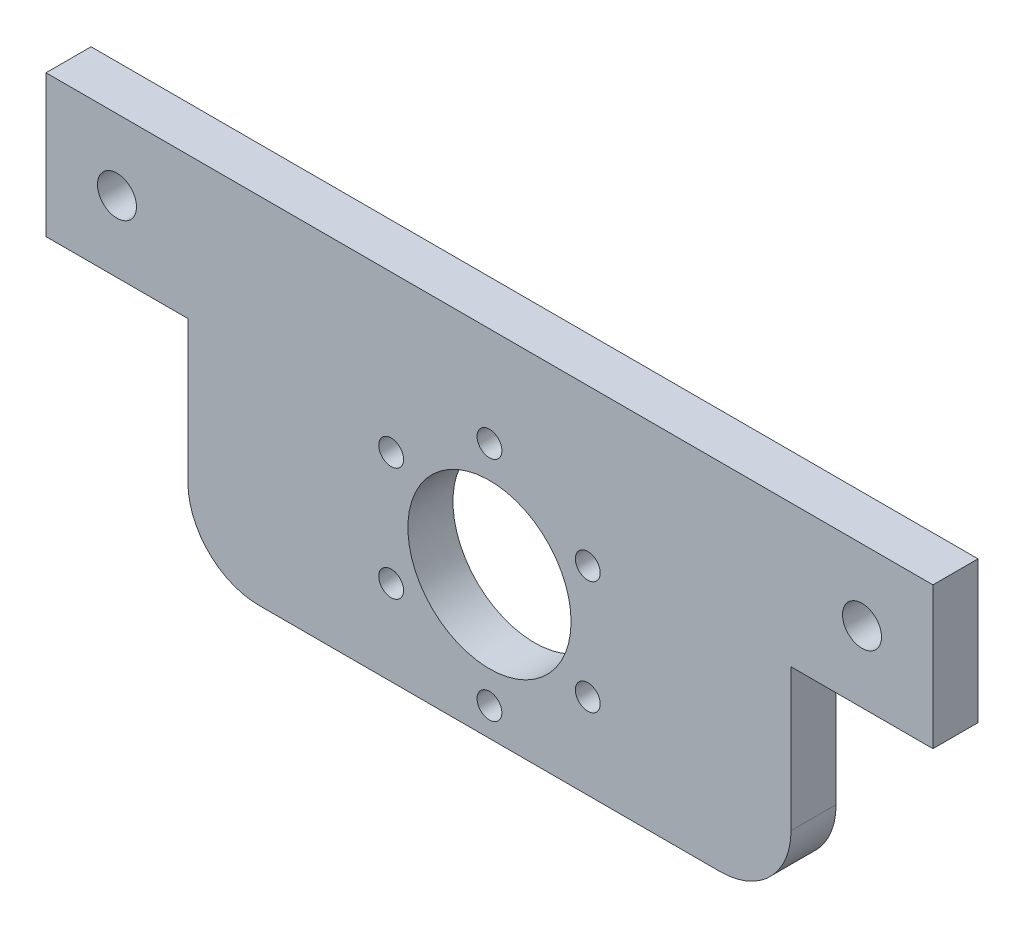
ISO-10303-21;
HEADER;
FILE_DESCRIPTION(('STEP AP214'),'2;1');
FILE_NAME('part.step','',(''),(''),'','','');
FILE_SCHEMA(('AUTOMOTIVE_DESIGN { 1 0 10303 214 1 1 1 1 }'));
ENDSEC;
DATA;
#1=APPLICATION_CONTEXT('core data for automotive mechanical design processes');
#2=APPLICATION_PROTOCOL_DEFINITION('international standard','automotive_design',2000,#1);
#3=PRODUCT_CONTEXT('',#1,'mechanical');
#4=PRODUCT('Part','Part','',(#3));
#5=PRODUCT_RELATED_PRODUCT_CATEGORY('part','',(#4));
#6=PRODUCT_DEFINITION_FORMATION('','',#4);
#7=PRODUCT_DEFINITION_CONTEXT('part definition',#1,'design');
#8=PRODUCT_DEFINITION('design','',#6,#7);
#9=PRODUCT_DEFINITION_SHAPE('','',#8);
#10=(LENGTH_UNIT() NAMED_UNIT(*) SI_UNIT(.MILLI.,.METRE.));
#11=(NAMED_UNIT(*) PLANE_ANGLE_UNIT() SI_UNIT($,.RADIAN.));
#12=(NAMED_UNIT(*) SI_UNIT($,.STERADIAN.) SOLID_ANGLE_UNIT());
#13=UNCERTAINTY_MEASURE_WITH_UNIT(LENGTH_MEASURE(1.E-05),#10,'distance_accuracy_value','');
#14=(GEOMETRIC_REPRESENTATION_CONTEXT(3) GLOBAL_UNCERTAINTY_ASSIGNED_CONTEXT((#13)) GLOBAL_UNIT_ASSIGNED_CONTEXT((#10,
#11,#12)) REPRESENTATION_CONTEXT('',''));
#15=CARTESIAN_POINT('',(0.,0.,0.));
#16=DIRECTION('',(0.,0.,1.));
#17=DIRECTION('',(1.,0.,0.));
#18=AXIS2_PLACEMENT_3D('',#15,#16,#17);
#19=CARTESIAN_POINT('',(0.,0.,6.35));
#20=DIRECTION('',(1.,0.,0.));
#21=DIRECTION('',(0.,0.,-1.));
#22=AXIS2_PLACEMENT_3D('',#19,#20,#21);
#23=PLANE('',#22);
#24=DIRECTION('',(0.,-1.,0.));
#25=VECTOR('',#24,1.);
#26=CARTESIAN_POINT('',(0.,0.,0.));
#27=LINE('',#26,#25);
#28=CARTESIAN_POINT('',(0.,50.,0.));
#29=VERTEX_POINT('',#28);
#30=CARTESIAN_POINT('',(0.,30.,0.));
#31=VERTEX_POINT('',#30);
#32=EDGE_CURVE('E207',#29,#31,#27,.T.);
#33=ORIENTED_EDGE('',*,*,#32,.T.);
#34=DIRECTION('',(0.,0.,-1.));
#35=VECTOR('',#34,1.);
#36=CARTESIAN_POINT('',(0.,30.,6.35));
#37=LINE('',#36,#35);
#38=CARTESIAN_POINT('',(0.,30.,6.35));
#39=VERTEX_POINT('',#38);
#40=EDGE_CURVE('E124',#39,#31,#37,.T.);
#41=ORIENTED_EDGE('',*,*,#40,.F.);
#42=DIRECTION('',(0.,-1.,0.));
#43=VECTOR('',#42,1.);
#44=CARTESIAN_POINT('',(0.,0.,6.35));
#45=LINE('',#44,#43);
#46=CARTESIAN_POINT('',(0.,50.,6.35));
#47=VERTEX_POINT('',#46);
#48=EDGE_CURVE('E210',#47,#39,#45,.T.);
#49=ORIENTED_EDGE('',*,*,#48,.F.);
#50=DIRECTION('',(0.,0.,-1.));
#51=VECTOR('',#50,1.);
#52=CARTESIAN_POINT('',(0.,50.,6.35));
#53=LINE('',#52,#51);
#54=EDGE_CURVE('E220',#47,#29,#53,.T.);
#55=ORIENTED_EDGE('',*,*,#54,.T.);
#56=EDGE_LOOP('',(#33,#41,#49,#55));
#57=FACE_BOUND('',#56,.T.);
#58=ADVANCED_FACE('F39',(#57),#23,.F.);
#59=CARTESIAN_POINT('',(0.,0.,6.35));
#60=DIRECTION('',(0.,1.,0.));
#61=DIRECTION('',(0.,0.,1.));
#62=AXIS2_PLACEMENT_3D('',#59,#60,#61);
#63=PLANE('',#62);
#64=DIRECTION('',(1.,0.,0.));
#65=VECTOR('',#64,1.);
#66=CARTESIAN_POINT('',(0.,0.,6.35));
#67=LINE('',#66,#65);
#68=CARTESIAN_POINT('',(30.,0.,6.35));
#69=VERTEX_POINT('',#68);
#70=CARTESIAN_POINT('',(95.,0.,6.35));
#71=VERTEX_POINT('',#70);
#72=EDGE_CURVE('E213',#69,#71,#67,.T.);
#73=ORIENTED_EDGE('',*,*,#72,.F.);
#74=DIRECTION('',(0.,0.,-1.));
#75=VECTOR('',#74,1.);
#76=CARTESIAN_POINT('',(30.,0.,6.35));
#77=LINE('',#76,#75);
#78=CARTESIAN_POINT('',(30.,0.,0.));
#79=VERTEX_POINT('',#78);
#80=EDGE_CURVE('E235',#69,#79,#77,.T.);
#81=ORIENTED_EDGE('',*,*,#80,.T.);
#82=DIRECTION('',(1.,0.,0.));
#83=VECTOR('',#82,1.);
#84=CARTESIAN_POINT('',(0.,0.,0.));
#85=LINE('',#84,#83);
#86=CARTESIAN_POINT('',(95.,0.,0.));
#87=VERTEX_POINT('',#86);
#88=EDGE_CURVE('E222',#79,#87,#85,.T.);
#89=ORIENTED_EDGE('',*,*,#88,.T.);
#90=DIRECTION('',(0.,0.,-1.));
#91=VECTOR('',#90,1.);
#92=CARTESIAN_POINT('',(95.,0.,6.35));
#93=LINE('',#92,#91);
#94=EDGE_CURVE('E233',#87,#71,#93,.F.);
#95=ORIENTED_EDGE('',*,*,#94,.T.);
#96=EDGE_LOOP('',(#73,#81,#89,#95));
#97=FACE_BOUND('',#96,.T.);
#98=ADVANCED_FACE('F248',(#97),#63,.F.);
#99=CARTESIAN_POINT('',(125.,0.,6.35));
#100=DIRECTION('',(-1.,0.,0.));
#101=DIRECTION('',(0.,0.,1.));
#102=AXIS2_PLACEMENT_3D('',#99,#100,#101);
#103=PLANE('',#102);
#104=DIRECTION('',(0.,1.,0.));
#105=VECTOR('',#104,1.);
#106=CARTESIAN_POINT('',(125.,0.,6.35));
#107=LINE('',#106,#105);
#108=CARTESIAN_POINT('',(125.,30.,6.35));
#109=VERTEX_POINT('',#108);
#110=CARTESIAN_POINT('',(125.,50.,6.35));
#111=VERTEX_POINT('',#110);
#112=EDGE_CURVE('E216',#109,#111,#107,.T.);
#113=ORIENTED_EDGE('',*,*,#112,.F.);
#114=DIRECTION('',(0.,0.,-1.));
#115=VECTOR('',#114,1.);
#116=CARTESIAN_POINT('',(125.,30.,6.35));
#117=LINE('',#116,#115);
#118=CARTESIAN_POINT('',(125.,30.,0.));
#119=VERTEX_POINT('',#118);
#120=EDGE_CURVE('E150',#109,#119,#117,.T.);
#121=ORIENTED_EDGE('',*,*,#120,.T.);
#122=DIRECTION('',(0.,1.,0.));
#123=VECTOR('',#122,1.);
#124=CARTESIAN_POINT('',(125.,0.,0.));
#125=LINE('',#124,#123);
#126=CARTESIAN_POINT('',(125.,50.,0.));
#127=VERTEX_POINT('',#126);
#128=EDGE_CURVE('E225',#119,#127,#125,.T.);
#129=ORIENTED_EDGE('',*,*,#128,.T.);
#130=DIRECTION('',(0.,0.,-1.));
#131=VECTOR('',#130,1.);
#132=CARTESIAN_POINT('',(125.,50.,6.35));
#133=LINE('',#132,#131);
#134=EDGE_CURVE('E230',#111,#127,#133,.T.);
#135=ORIENTED_EDGE('',*,*,#134,.F.);
#136=EDGE_LOOP('',(#113,#121,#129,#135));
#137=FACE_BOUND('',#136,.T.);
#138=ADVANCED_FACE('F269',(#137),#103,.F.);
#139=CARTESIAN_POINT('',(0.,50.,6.35));
#140=DIRECTION('',(0.,-1.,0.));
#141=DIRECTION('',(0.,0.,-1.));
#142=AXIS2_PLACEMENT_3D('',#139,#140,#141);
#143=PLANE('',#142);
#144=DIRECTION('',(-1.,0.,0.));
#145=VECTOR('',#144,1.);
#146=CARTESIAN_POINT('',(0.,50.,0.));
#147=LINE('',#146,#145);
#148=EDGE_CURVE('E214',#127,#29,#147,.T.);
#149=ORIENTED_EDGE('',*,*,#148,.T.);
#150=ORIENTED_EDGE('',*,*,#54,.F.);
#151=DIRECTION('',(-1.,0.,0.));
#152=VECTOR('',#151,1.);
#153=CARTESIAN_POINT('',(0.,50.,6.35));
#154=LINE('',#153,#152);
#155=EDGE_CURVE('E218',#111,#47,#154,.T.);
#156=ORIENTED_EDGE('',*,*,#155,.F.);
#157=ORIENTED_EDGE('',*,*,#134,.T.);
#158=EDGE_LOOP('',(#149,#150,#156,#157));
#159=FACE_BOUND('',#158,.T.);
#160=ADVANCED_FACE('F273',(#159),#143,.F.);
#161=CARTESIAN_POINT('',(0.,0.,6.35));
#162=DIRECTION('',(0.,0.,-1.));
#163=DIRECTION('',(-1.,0.,0.));
#164=AXIS2_PLACEMENT_3D('',#161,#162,#163);
#165=PLANE('',#164);
#166=CARTESIAN_POINT('',(10.,40.,6.35));
#167=DIRECTION('',(0.,0.,-1.));
#168=DIRECTION('',(-1.,0.,0.));
#169=AXIS2_PLACEMENT_3D('',#166,#167,#168);
#170=CIRCLE('',#169,2.75);
#171=CARTESIAN_POINT('',(7.25,40.,6.35));
#172=VERTEX_POINT('',#171);
#173=EDGE_CURVE('E134',#172,#172,#170,.T.);
#174=ORIENTED_EDGE('',*,*,#173,.T.);
#175=EDGE_LOOP('',(#174));
#176=FACE_BOUND('',#175,.T.);
#177=CARTESIAN_POINT('',(115.,40.,6.35));
#178=DIRECTION('',(0.,0.,-1.));
#179=DIRECTION('',(-1.,0.,0.));
#180=AXIS2_PLACEMENT_3D('',#177,#178,#179);
#181=CIRCLE('',#180,2.75000000000001);
#182=CARTESIAN_POINT('',(112.25,40.,6.35));
#183=VERTEX_POINT('',#182);
#184=EDGE_CURVE('E160',#183,#183,#181,.T.);
#185=ORIENTED_EDGE('',*,*,#184,.T.);
#186=EDGE_LOOP('',(#185));
#187=FACE_BOUND('',#186,.T.);
#188=CARTESIAN_POINT('',(62.5,36.,6.35));
#189=DIRECTION('',(0.,0.,-1.));
#190=DIRECTION('',(-1.,0.,0.));
#191=AXIS2_PLACEMENT_3D('',#188,#189,#190);
#192=CIRCLE('',#191,1.75);
#193=CARTESIAN_POINT('',(60.75,36.,6.35));
#194=VERTEX_POINT('',#193);
#195=EDGE_CURVE('E163',#194,#194,#192,.T.);
#196=ORIENTED_EDGE('',*,*,#195,.T.);
#197=EDGE_LOOP('',(#196));
#198=FACE_BOUND('',#197,.T.);
#199=CARTESIAN_POINT('',(76.356406460551,28.,6.35));
#200=DIRECTION('',(0.,0.,-1.));
#201=DIRECTION('',(-1.,0.,0.));
#202=AXIS2_PLACEMENT_3D('',#199,#200,#201);
#203=CIRCLE('',#202,1.75);
#204=CARTESIAN_POINT('',(74.606406460551,28.,6.35));
#205=VERTEX_POINT('',#204);
#206=EDGE_CURVE('E190',#205,#205,#203,.T.);
#207=ORIENTED_EDGE('',*,*,#206,.T.);
#208=EDGE_LOOP('',(#207));
#209=FACE_BOUND('',#208,.T.);
#210=CARTESIAN_POINT('',(76.356406460551,12.,6.35));
#211=DIRECTION('',(0.,0.,-1.));
#212=DIRECTION('',(-1.,0.,0.));
#213=AXIS2_PLACEMENT_3D('',#210,#211,#212);
#214=CIRCLE('',#213,1.75);
#215=CARTESIAN_POINT('',(74.606406460551,12.,6.35));
#216=VERTEX_POINT('',#215);
#217=EDGE_CURVE('E184',#216,#216,#214,.T.);
#218=ORIENTED_EDGE('',*,*,#217,.T.);
#219=EDGE_LOOP('',(#218));
#220=FACE_BOUND('',#219,.T.);
#221=CARTESIAN_POINT('',(62.5,4.00000000000001,6.35));
#222=DIRECTION('',(0.,0.,-1.));
#223=DIRECTION('',(-1.,0.,0.));
#224=AXIS2_PLACEMENT_3D('',#221,#222,#223);
#225=CIRCLE('',#224,1.75);
#226=CARTESIAN_POINT('',(60.75,4.00000000000001,6.35));
#227=VERTEX_POINT('',#226);
#228=EDGE_CURVE('E178',#227,#227,#225,.T.);
#229=ORIENTED_EDGE('',*,*,#228,.T.);
#230=EDGE_LOOP('',(#229));
#231=FACE_BOUND('',#230,.T.);
#232=CARTESIAN_POINT('',(48.643593539449,12.,6.35));
#233=DIRECTION('',(0.,0.,-1.));
#234=DIRECTION('',(-1.,0.,0.));
#235=AXIS2_PLACEMENT_3D('',#232,#233,#234);
#236=CIRCLE('',#235,1.75);
#237=CARTESIAN_POINT('',(46.893593539449,12.,6.35));
#238=VERTEX_POINT('',#237);
#239=EDGE_CURVE('E172',#238,#238,#236,.T.);
#240=ORIENTED_EDGE('',*,*,#239,.T.);
#241=EDGE_LOOP('',(#240));
#242=FACE_BOUND('',#241,.T.);
#243=CARTESIAN_POINT('',(48.643593539449,28.,6.35));
#244=DIRECTION('',(0.,0.,-1.));
#245=DIRECTION('',(-1.,0.,0.));
#246=AXIS2_PLACEMENT_3D('',#243,#244,#245);
#247=CIRCLE('',#246,1.75);
#248=CARTESIAN_POINT('',(46.893593539449,28.,6.35));
#249=VERTEX_POINT('',#248);
#250=EDGE_CURVE('E198',#249,#249,#247,.T.);
#251=ORIENTED_EDGE('',*,*,#250,.T.);
#252=EDGE_LOOP('',(#251));
#253=FACE_BOUND('',#252,.T.);
#254=CARTESIAN_POINT('',(62.5,20.,6.35));
#255=DIRECTION('',(0.,0.,1.));
#256=DIRECTION('',(1.,0.,0.));
#257=AXIS2_PLACEMENT_3D('',#254,#255,#256);
#258=CIRCLE('',#257,11.5);
#259=CARTESIAN_POINT('',(74.,20.,6.35));
#260=VERTEX_POINT('',#259);
#261=EDGE_CURVE('E201',#260,#260,#258,.T.);
#262=ORIENTED_EDGE('',*,*,#261,.F.);
#263=EDGE_LOOP('',(#262));
#264=FACE_BOUND('',#263,.T.);
#265=DIRECTION('',(0.,-1.,0.));
#266=VECTOR('',#265,1.);
#267=CARTESIAN_POINT('',(20.,0.,6.35));
#268=LINE('',#267,#266);
#269=CARTESIAN_POINT('',(20.,30.,6.35));
#270=VERTEX_POINT('',#269);
#271=CARTESIAN_POINT('',(20.,10.,6.35));
#272=VERTEX_POINT('',#271);
#273=EDGE_CURVE('E121',#270,#272,#268,.T.);
#274=ORIENTED_EDGE('',*,*,#273,.T.);
#275=CARTESIAN_POINT('',(30.,10.,6.35));
#276=DIRECTION('',(0.,0.,-1.));
#277=DIRECTION('',(-1.,0.,0.));
#278=AXIS2_PLACEMENT_3D('',#275,#276,#277);
#279=CIRCLE('',#278,10.);
#280=EDGE_CURVE('E47',#272,#69,#279,.F.);
#281=ORIENTED_EDGE('',*,*,#280,.T.);
#282=ORIENTED_EDGE('',*,*,#72,.T.);
#283=CARTESIAN_POINT('',(95.,10.,6.35));
#284=DIRECTION('',(0.,0.,-1.));
#285=DIRECTION('',(-1.,0.,0.));
#286=AXIS2_PLACEMENT_3D('',#283,#284,#285);
#287=CIRCLE('',#286,10.);
#288=CARTESIAN_POINT('',(105.,10.,6.35));
#289=VERTEX_POINT('',#288);
#290=EDGE_CURVE('E54',#71,#289,#287,.F.);
#291=ORIENTED_EDGE('',*,*,#290,.T.);
#292=DIRECTION('',(0.,1.,0.));
#293=VECTOR('',#292,1.);
#294=CARTESIAN_POINT('',(105.,0.,6.35));
#295=LINE('',#294,#293);
#296=CARTESIAN_POINT('',(105.,30.,6.35));
#297=VERTEX_POINT('',#296);
#298=EDGE_CURVE('E155',#289,#297,#295,.T.);
#299=ORIENTED_EDGE('',*,*,#298,.T.);
#300=DIRECTION('',(1.,0.,0.));
#301=VECTOR('',#300,1.);
#302=CARTESIAN_POINT('',(125.,30.,6.35));
#303=LINE('',#302,#301);
#304=EDGE_CURVE('E149',#297,#109,#303,.T.);
#305=ORIENTED_EDGE('',*,*,#304,.T.);
#306=ORIENTED_EDGE('',*,*,#112,.T.);
#307=ORIENTED_EDGE('',*,*,#155,.T.);
#308=ORIENTED_EDGE('',*,*,#48,.T.);
#309=DIRECTION('',(1.,0.,0.));
#310=VECTOR('',#309,1.);
#311=CARTESIAN_POINT('',(0.,30.,6.35));
#312=LINE('',#311,#310);
#313=EDGE_CURVE('E140',#39,#270,#312,.T.);
#314=ORIENTED_EDGE('',*,*,#313,.T.);
#315=EDGE_LOOP('',(#274,#281,#282,#291,#299,#305,#306,#307,#308,#314));
#316=FACE_BOUND('',#315,.T.);
#317=ADVANCED_FACE('F244',(#176,#187,#198,#209,#220,#231,#242,#253,#264,#316),#165,.F.);
#318=CARTESIAN_POINT('',(0.,0.,0.));
#319=DIRECTION('',(0.,0.,-1.));
#320=DIRECTION('',(-1.,0.,0.));
#321=AXIS2_PLACEMENT_3D('',#318,#319,#320);
#322=PLANE('',#321);
#323=ORIENTED_EDGE('',*,*,#88,.F.);
#324=CARTESIAN_POINT('',(30.,10.,0.));
#325=DIRECTION('',(0.,0.,-1.));
#326=DIRECTION('',(-1.,0.,0.));
#327=AXIS2_PLACEMENT_3D('',#324,#325,#326);
#328=CIRCLE('',#327,10.);
#329=CARTESIAN_POINT('',(20.,10.,0.));
#330=VERTEX_POINT('',#329);
#331=EDGE_CURVE('E139',#79,#330,#328,.T.);
#332=ORIENTED_EDGE('',*,*,#331,.T.);
#333=DIRECTION('',(0.,-1.,0.));
#334=VECTOR('',#333,1.);
#335=CARTESIAN_POINT('',(20.,0.,0.));
#336=LINE('',#335,#334);
#337=CARTESIAN_POINT('',(20.,30.,0.));
#338=VERTEX_POINT('',#337);
#339=EDGE_CURVE('E120',#338,#330,#336,.T.);
#340=ORIENTED_EDGE('',*,*,#339,.F.);
#341=DIRECTION('',(1.,0.,0.));
#342=VECTOR('',#341,1.);
#343=CARTESIAN_POINT('',(0.,30.,0.));
#344=LINE('',#343,#342);
#345=EDGE_CURVE('E128',#31,#338,#344,.T.);
#346=ORIENTED_EDGE('',*,*,#345,.F.);
#347=ORIENTED_EDGE('',*,*,#32,.F.);
#348=ORIENTED_EDGE('',*,*,#148,.F.);
#349=ORIENTED_EDGE('',*,*,#128,.F.);
#350=DIRECTION('',(1.,0.,0.));
#351=VECTOR('',#350,1.);
#352=CARTESIAN_POINT('',(125.,30.,0.));
#353=LINE('',#352,#351);
#354=CARTESIAN_POINT('',(105.,30.,0.));
#355=VERTEX_POINT('',#354);
#356=EDGE_CURVE('E153',#355,#119,#353,.T.);
#357=ORIENTED_EDGE('',*,*,#356,.F.);
#358=DIRECTION('',(0.,1.,0.));
#359=VECTOR('',#358,1.);
#360=CARTESIAN_POINT('',(105.,0.,0.));
#361=LINE('',#360,#359);
#362=CARTESIAN_POINT('',(105.,10.,0.));
#363=VERTEX_POINT('',#362);
#364=EDGE_CURVE('E125',#363,#355,#361,.T.);
#365=ORIENTED_EDGE('',*,*,#364,.F.);
#366=CARTESIAN_POINT('',(95.,10.,0.));
#367=DIRECTION('',(0.,0.,-1.));
#368=DIRECTION('',(-1.,0.,0.));
#369=AXIS2_PLACEMENT_3D('',#366,#367,#368);
#370=CIRCLE('',#369,10.);
#371=EDGE_CURVE('E238',#363,#87,#370,.T.);
#372=ORIENTED_EDGE('',*,*,#371,.T.);
#373=EDGE_LOOP('',(#323,#332,#340,#346,#347,#348,#349,#357,#365,#372));
#374=FACE_BOUND('',#373,.T.);
#375=CARTESIAN_POINT('',(10.,40.,0.));
#376=DIRECTION('',(0.,0.,-1.));
#377=DIRECTION('',(-1.,0.,0.));
#378=AXIS2_PLACEMENT_3D('',#375,#376,#377);
#379=CIRCLE('',#378,2.75);
#380=CARTESIAN_POINT('',(7.25,40.,0.));
#381=VERTEX_POINT('',#380);
#382=EDGE_CURVE('E167',#381,#381,#379,.T.);
#383=ORIENTED_EDGE('',*,*,#382,.F.);
#384=EDGE_LOOP('',(#383));
#385=FACE_BOUND('',#384,.T.);
#386=CARTESIAN_POINT('',(115.,40.,0.));
#387=DIRECTION('',(0.,0.,-1.));
#388=DIRECTION('',(-1.,0.,0.));
#389=AXIS2_PLACEMENT_3D('',#386,#387,#388);
#390=CIRCLE('',#389,2.75000000000001);
#391=CARTESIAN_POINT('',(112.25,40.,0.));
#392=VERTEX_POINT('',#391);
#393=EDGE_CURVE('E164',#392,#392,#390,.T.);
#394=ORIENTED_EDGE('',*,*,#393,.F.);
#395=EDGE_LOOP('',(#394));
#396=FACE_BOUND('',#395,.T.);
#397=CARTESIAN_POINT('',(62.5,36.,0.));
#398=DIRECTION('',(0.,0.,-1.));
#399=DIRECTION('',(-1.,0.,0.));
#400=AXIS2_PLACEMENT_3D('',#397,#398,#399);
#401=CIRCLE('',#400,1.75);
#402=CARTESIAN_POINT('',(60.75,36.,0.));
#403=VERTEX_POINT('',#402);
#404=EDGE_CURVE('E193',#403,#403,#401,.T.);
#405=ORIENTED_EDGE('',*,*,#404,.F.);
#406=EDGE_LOOP('',(#405));
#407=FACE_BOUND('',#406,.T.);
#408=CARTESIAN_POINT('',(76.356406460551,28.,0.));
#409=DIRECTION('',(0.,0.,-1.));
#410=DIRECTION('',(-1.,0.,0.));
#411=AXIS2_PLACEMENT_3D('',#408,#409,#410);
#412=CIRCLE('',#411,1.75);
#413=CARTESIAN_POINT('',(74.606406460551,28.,0.));
#414=VERTEX_POINT('',#413);
#415=EDGE_CURVE('E187',#414,#414,#412,.T.);
#416=ORIENTED_EDGE('',*,*,#415,.F.);
#417=EDGE_LOOP('',(#416));
#418=FACE_BOUND('',#417,.T.);
#419=CARTESIAN_POINT('',(76.356406460551,12.,0.));
#420=DIRECTION('',(0.,0.,-1.));
#421=DIRECTION('',(-1.,0.,0.));
#422=AXIS2_PLACEMENT_3D('',#419,#420,#421);
#423=CIRCLE('',#422,1.75);
#424=CARTESIAN_POINT('',(74.606406460551,12.,0.));
#425=VERTEX_POINT('',#424);
#426=EDGE_CURVE('E181',#425,#425,#423,.T.);
#427=ORIENTED_EDGE('',*,*,#426,.F.);
#428=EDGE_LOOP('',(#427));
#429=FACE_BOUND('',#428,.T.);
#430=CARTESIAN_POINT('',(62.5,4.00000000000001,0.));
#431=DIRECTION('',(0.,0.,-1.));
#432=DIRECTION('',(-1.,0.,0.));
#433=AXIS2_PLACEMENT_3D('',#430,#431,#432);
#434=CIRCLE('',#433,1.75);
#435=CARTESIAN_POINT('',(60.75,4.00000000000001,0.));
#436=VERTEX_POINT('',#435);
#437=EDGE_CURVE('E175',#436,#436,#434,.T.);
#438=ORIENTED_EDGE('',*,*,#437,.F.);
#439=EDGE_LOOP('',(#438));
#440=FACE_BOUND('',#439,.T.);
#441=CARTESIAN_POINT('',(48.643593539449,12.,0.));
#442=DIRECTION('',(0.,0.,-1.));
#443=DIRECTION('',(-1.,0.,0.));
#444=AXIS2_PLACEMENT_3D('',#441,#442,#443);
#445=CIRCLE('',#444,1.75);
#446=CARTESIAN_POINT('',(46.893593539449,12.,0.));
#447=VERTEX_POINT('',#446);
#448=EDGE_CURVE('E168',#447,#447,#445,.T.);
#449=ORIENTED_EDGE('',*,*,#448,.F.);
#450=EDGE_LOOP('',(#449));
#451=FACE_BOUND('',#450,.T.);
#452=CARTESIAN_POINT('',(48.643593539449,28.,0.));
#453=DIRECTION('',(0.,0.,-1.));
#454=DIRECTION('',(-1.,0.,0.));
#455=AXIS2_PLACEMENT_3D('',#452,#453,#454);
#456=CIRCLE('',#455,1.75);
#457=CARTESIAN_POINT('',(46.893593539449,28.,0.));
#458=VERTEX_POINT('',#457);
#459=EDGE_CURVE('E171',#458,#458,#456,.T.);
#460=ORIENTED_EDGE('',*,*,#459,.F.);
#461=EDGE_LOOP('',(#460));
#462=FACE_BOUND('',#461,.T.);
#463=CARTESIAN_POINT('',(62.5,20.,0.));
#464=DIRECTION('',(0.,0.,1.));
#465=DIRECTION('',(1.,0.,0.));
#466=AXIS2_PLACEMENT_3D('',#463,#464,#465);
#467=CIRCLE('',#466,11.5);
#468=CARTESIAN_POINT('',(74.,20.,0.));
#469=VERTEX_POINT('',#468);
#470=EDGE_CURVE('E204',#469,#469,#467,.T.);
#471=ORIENTED_EDGE('',*,*,#470,.T.);
#472=EDGE_LOOP('',(#471));
#473=FACE_BOUND('',#472,.T.);
#474=ADVANCED_FACE('F137',(#374,#385,#396,#407,#418,#429,#440,#451,#462,#473),#322,.T.);
#475=CARTESIAN_POINT('',(62.5,20.,0.));
#476=DIRECTION('',(0.,0.,1.));
#477=DIRECTION('',(1.,0.,0.));
#478=AXIS2_PLACEMENT_3D('',#475,#476,#477);
#479=CYLINDRICAL_SURFACE('',#478,11.5);
#480=ORIENTED_EDGE('',*,*,#470,.F.);
#481=EDGE_LOOP('',(#480));
#482=FACE_BOUND('',#481,.T.);
#483=ORIENTED_EDGE('',*,*,#261,.T.);
#484=EDGE_LOOP('',(#483));
#485=FACE_BOUND('',#484,.T.);
#486=ADVANCED_FACE('F280',(#482,#485),#479,.F.);
#487=CARTESIAN_POINT('',(48.643593539449,28.,6.35));
#488=DIRECTION('',(0.,0.,-1.));
#489=DIRECTION('',(-1.,0.,0.));
#490=AXIS2_PLACEMENT_3D('',#487,#488,#489);
#491=CYLINDRICAL_SURFACE('',#490,1.75);
#492=ORIENTED_EDGE('',*,*,#250,.F.);
#493=EDGE_LOOP('',(#492));
#494=FACE_BOUND('',#493,.T.);
#495=ORIENTED_EDGE('',*,*,#459,.T.);
#496=EDGE_LOOP('',(#495));
#497=FACE_BOUND('',#496,.T.);
#498=ADVANCED_FACE('F286',(#494,#497),#491,.F.);
#499=CARTESIAN_POINT('',(48.643593539449,12.,6.35));
#500=DIRECTION('',(0.,0.,-1.));
#501=DIRECTION('',(-1.,0.,0.));
#502=AXIS2_PLACEMENT_3D('',#499,#500,#501);
#503=CYLINDRICAL_SURFACE('',#502,1.75);
#504=ORIENTED_EDGE('',*,*,#239,.F.);
#505=EDGE_LOOP('',(#504));
#506=FACE_BOUND('',#505,.T.);
#507=ORIENTED_EDGE('',*,*,#448,.T.);
#508=EDGE_LOOP('',(#507));
#509=FACE_BOUND('',#508,.T.);
#510=ADVANCED_FACE('F290',(#506,#509),#503,.F.);
#511=CARTESIAN_POINT('',(62.5,4.00000000000001,6.35));
#512=DIRECTION('',(0.,0.,-1.));
#513=DIRECTION('',(-1.,0.,0.));
#514=AXIS2_PLACEMENT_3D('',#511,#512,#513);
#515=CYLINDRICAL_SURFACE('',#514,1.75);
#516=ORIENTED_EDGE('',*,*,#228,.F.);
#517=EDGE_LOOP('',(#516));
#518=FACE_BOUND('',#517,.T.);
#519=ORIENTED_EDGE('',*,*,#437,.T.);
#520=EDGE_LOOP('',(#519));
#521=FACE_BOUND('',#520,.T.);
#522=ADVANCED_FACE('F303',(#518,#521),#515,.F.);
#523=CARTESIAN_POINT('',(76.356406460551,12.,6.35));
#524=DIRECTION('',(0.,0.,-1.));
#525=DIRECTION('',(-1.,0.,0.));
#526=AXIS2_PLACEMENT_3D('',#523,#524,#525);
#527=CYLINDRICAL_SURFACE('',#526,1.75);
#528=ORIENTED_EDGE('',*,*,#217,.F.);
#529=EDGE_LOOP('',(#528));
#530=FACE_BOUND('',#529,.T.);
#531=ORIENTED_EDGE('',*,*,#426,.T.);
#532=EDGE_LOOP('',(#531));
#533=FACE_BOUND('',#532,.T.);
#534=ADVANCED_FACE('F299',(#530,#533),#527,.F.);
#535=CARTESIAN_POINT('',(76.356406460551,28.,6.35));
#536=DIRECTION('',(0.,0.,-1.));
#537=DIRECTION('',(-1.,0.,0.));
#538=AXIS2_PLACEMENT_3D('',#535,#536,#537);
#539=CYLINDRICAL_SURFACE('',#538,1.75);
#540=ORIENTED_EDGE('',*,*,#206,.F.);
#541=EDGE_LOOP('',(#540));
#542=FACE_BOUND('',#541,.T.);
#543=ORIENTED_EDGE('',*,*,#415,.T.);
#544=EDGE_LOOP('',(#543));
#545=FACE_BOUND('',#544,.T.);
#546=ADVANCED_FACE('F295',(#542,#545),#539,.F.);
#547=CARTESIAN_POINT('',(62.5,36.,6.35));
#548=DIRECTION('',(0.,0.,-1.));
#549=DIRECTION('',(-1.,0.,0.));
#550=AXIS2_PLACEMENT_3D('',#547,#548,#549);
#551=CYLINDRICAL_SURFACE('',#550,1.75);
#552=ORIENTED_EDGE('',*,*,#195,.F.);
#553=EDGE_LOOP('',(#552));
#554=FACE_BOUND('',#553,.T.);
#555=ORIENTED_EDGE('',*,*,#404,.T.);
#556=EDGE_LOOP('',(#555));
#557=FACE_BOUND('',#556,.T.);
#558=ADVANCED_FACE('F292',(#554,#557),#551,.F.);
#559=CARTESIAN_POINT('',(115.,40.,6.35));
#560=DIRECTION('',(0.,0.,-1.));
#561=DIRECTION('',(-1.,0.,0.));
#562=AXIS2_PLACEMENT_3D('',#559,#560,#561);
#563=CYLINDRICAL_SURFACE('',#562,2.75000000000001);
#564=ORIENTED_EDGE('',*,*,#184,.F.);
#565=EDGE_LOOP('',(#564));
#566=FACE_BOUND('',#565,.T.);
#567=ORIENTED_EDGE('',*,*,#393,.T.);
#568=EDGE_LOOP('',(#567));
#569=FACE_BOUND('',#568,.T.);
#570=ADVANCED_FACE('F294',(#566,#569),#563,.F.);
#571=CARTESIAN_POINT('',(10.,40.,6.35));
#572=DIRECTION('',(0.,0.,-1.));
#573=DIRECTION('',(-1.,0.,0.));
#574=AXIS2_PLACEMENT_3D('',#571,#572,#573);
#575=CYLINDRICAL_SURFACE('',#574,2.75);
#576=ORIENTED_EDGE('',*,*,#173,.F.);
#577=EDGE_LOOP('',(#576));
#578=FACE_BOUND('',#577,.T.);
#579=ORIENTED_EDGE('',*,*,#382,.T.);
#580=EDGE_LOOP('',(#579));
#581=FACE_BOUND('',#580,.T.);
#582=ADVANCED_FACE('F313',(#578,#581),#575,.F.);
#583=CARTESIAN_POINT('',(20.,0.,6.35));
#584=DIRECTION('',(1.,0.,0.));
#585=DIRECTION('',(0.,0.,-1.));
#586=AXIS2_PLACEMENT_3D('',#583,#584,#585);
#587=PLANE('',#586);
#588=ORIENTED_EDGE('',*,*,#339,.T.);
#589=DIRECTION('',(0.,0.,-1.));
#590=VECTOR('',#589,1.);
#591=CARTESIAN_POINT('',(20.,10.,6.35));
#592=LINE('',#591,#590);
#593=EDGE_CURVE('E62',#330,#272,#592,.F.);
#594=ORIENTED_EDGE('',*,*,#593,.T.);
#595=ORIENTED_EDGE('',*,*,#273,.F.);
#596=DIRECTION('',(0.,0.,-1.));
#597=VECTOR('',#596,1.);
#598=CARTESIAN_POINT('',(20.,30.,6.35));
#599=LINE('',#598,#597);
#600=EDGE_CURVE('E116',#270,#338,#599,.T.);
#601=ORIENTED_EDGE('',*,*,#600,.T.);
#602=EDGE_LOOP('',(#588,#594,#595,#601));
#603=FACE_BOUND('',#602,.T.);
#604=ADVANCED_FACE('F118',(#603),#587,.F.);
#605=CARTESIAN_POINT('',(0.,30.,6.35));
#606=DIRECTION('',(0.,1.,0.));
#607=DIRECTION('',(-1.,0.,0.));
#608=AXIS2_PLACEMENT_3D('',#605,#606,#607);
#609=PLANE('',#608);
#610=ORIENTED_EDGE('',*,*,#345,.T.);
#611=ORIENTED_EDGE('',*,*,#600,.F.);
#612=ORIENTED_EDGE('',*,*,#313,.F.);
#613=ORIENTED_EDGE('',*,*,#40,.T.);
#614=EDGE_LOOP('',(#610,#611,#612,#613));
#615=FACE_BOUND('',#614,.T.);
#616=ADVANCED_FACE('F129',(#615),#609,.F.);
#617=CARTESIAN_POINT('',(125.,30.,6.35));
#618=DIRECTION('',(0.,1.,0.));
#619=DIRECTION('',(0.,0.,1.));
#620=AXIS2_PLACEMENT_3D('',#617,#618,#619);
#621=PLANE('',#620);
#622=ORIENTED_EDGE('',*,*,#356,.T.);
#623=ORIENTED_EDGE('',*,*,#120,.F.);
#624=ORIENTED_EDGE('',*,*,#304,.F.);
#625=DIRECTION('',(0.,0.,-1.));
#626=VECTOR('',#625,1.);
#627=CARTESIAN_POINT('',(105.,30.,6.35));
#628=LINE('',#627,#626);
#629=EDGE_CURVE('E146',#297,#355,#628,.T.);
#630=ORIENTED_EDGE('',*,*,#629,.T.);
#631=EDGE_LOOP('',(#622,#623,#624,#630));
#632=FACE_BOUND('',#631,.T.);
#633=ADVANCED_FACE('F258',(#632),#621,.F.);
#634=CARTESIAN_POINT('',(105.,0.,6.35));
#635=DIRECTION('',(-1.,0.,0.));
#636=DIRECTION('',(0.,0.,1.));
#637=AXIS2_PLACEMENT_3D('',#634,#635,#636);
#638=PLANE('',#637);
#639=ORIENTED_EDGE('',*,*,#298,.F.);
#640=DIRECTION('',(0.,0.,-1.));
#641=VECTOR('',#640,1.);
#642=CARTESIAN_POINT('',(105.,10.,6.35));
#643=LINE('',#642,#641);
#644=EDGE_CURVE('E11',#289,#363,#643,.T.);
#645=ORIENTED_EDGE('',*,*,#644,.T.);
#646=ORIENTED_EDGE('',*,*,#364,.T.);
#647=ORIENTED_EDGE('',*,*,#629,.F.);
#648=EDGE_LOOP('',(#639,#645,#646,#647));
#649=FACE_BOUND('',#648,.T.);
#650=ADVANCED_FACE('F252',(#649),#638,.F.);
#651=CARTESIAN_POINT('',(30.,10.,6.35));
#652=DIRECTION('',(0.,0.,-1.));
#653=DIRECTION('',(-1.,0.,0.));
#654=AXIS2_PLACEMENT_3D('',#651,#652,#653);
#655=CYLINDRICAL_SURFACE('',#654,10.);
#656=ORIENTED_EDGE('',*,*,#280,.F.);
#657=ORIENTED_EDGE('',*,*,#593,.F.);
#658=ORIENTED_EDGE('',*,*,#331,.F.);
#659=ORIENTED_EDGE('',*,*,#80,.F.);
#660=EDGE_LOOP('',(#656,#657,#658,#659));
#661=FACE_BOUND('',#660,.T.);
#662=ADVANCED_FACE('F250',(#661),#655,.T.);
#663=CARTESIAN_POINT('',(95.,10.,6.35));
#664=DIRECTION('',(0.,0.,-1.));
#665=DIRECTION('',(-1.,0.,0.));
#666=AXIS2_PLACEMENT_3D('',#663,#664,#665);
#667=CYLINDRICAL_SURFACE('',#666,10.);
#668=ORIENTED_EDGE('',*,*,#290,.F.);
#669=ORIENTED_EDGE('',*,*,#94,.F.);
#670=ORIENTED_EDGE('',*,*,#371,.F.);
#671=ORIENTED_EDGE('',*,*,#644,.F.);
#672=EDGE_LOOP('',(#668,#669,#670,#671));
#673=FACE_BOUND('',#672,.T.);
#674=ADVANCED_FACE('F41',(#673),#667,.T.);
#675=CLOSED_SHELL('',(#58,#98,#138,#160,#317,#474,#486,#498,#510,#522,#534,#546,#558,#570,#582,
#604,#616,#633,#650,#662,#674));
#676=MANIFOLD_SOLID_BREP('B2',#675);
#677=ADVANCED_BREP_SHAPE_REPRESENTATION('',(#18,#676),#14);
#678=SHAPE_DEFINITION_REPRESENTATION(#9,#677);
ENDSEC;
END-ISO-10303-21;
